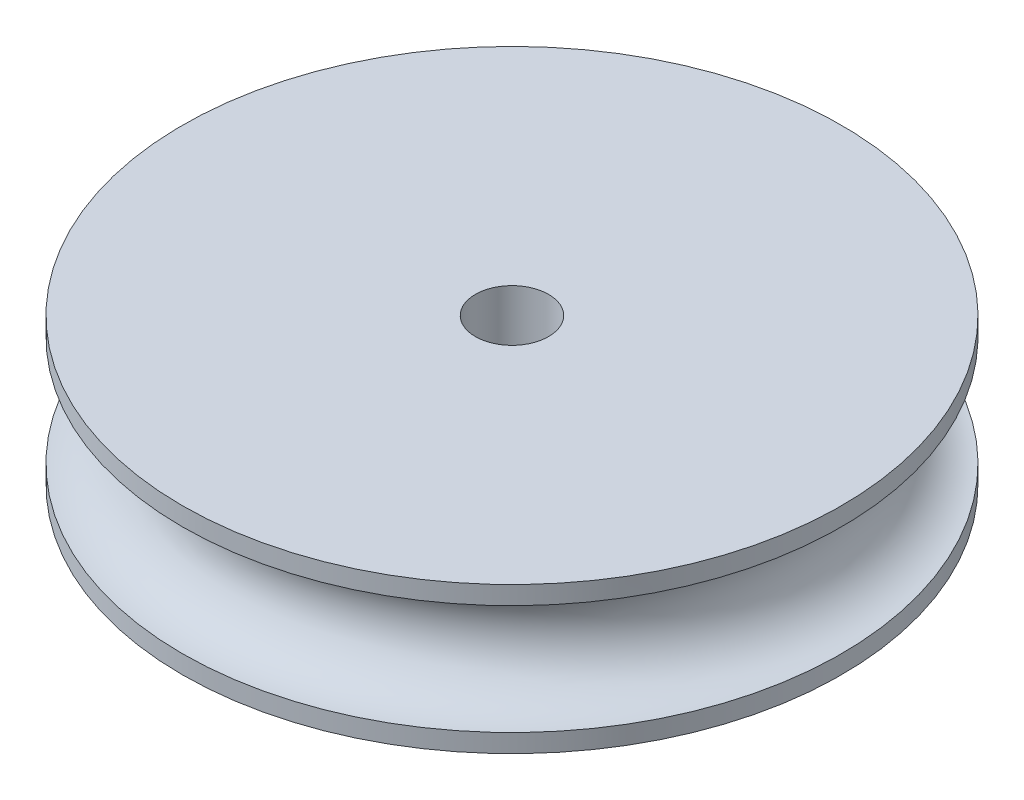
ISO-10303-21;
HEADER;
FILE_DESCRIPTION(('STEP AP214'),'2;1');
FILE_NAME('part.step','',(''),(''),'','','');
FILE_SCHEMA(('AUTOMOTIVE_DESIGN { 1 0 10303 214 1 1 1 1 }'));
ENDSEC;
DATA;
#1=APPLICATION_CONTEXT('core data for automotive mechanical design processes');
#2=APPLICATION_PROTOCOL_DEFINITION('international standard','automotive_design',2000,#1);
#3=PRODUCT_CONTEXT('',#1,'mechanical');
#4=PRODUCT('Part','Part','',(#3));
#5=PRODUCT_RELATED_PRODUCT_CATEGORY('part','',(#4));
#6=PRODUCT_DEFINITION_FORMATION('','',#4);
#7=PRODUCT_DEFINITION_CONTEXT('part definition',#1,'design');
#8=PRODUCT_DEFINITION('design','',#6,#7);
#9=PRODUCT_DEFINITION_SHAPE('','',#8);
#10=(LENGTH_UNIT() NAMED_UNIT(*) SI_UNIT(.MILLI.,.METRE.));
#11=(NAMED_UNIT(*) PLANE_ANGLE_UNIT() SI_UNIT($,.RADIAN.));
#12=(NAMED_UNIT(*) SI_UNIT($,.STERADIAN.) SOLID_ANGLE_UNIT());
#13=UNCERTAINTY_MEASURE_WITH_UNIT(LENGTH_MEASURE(1.E-05),#10,'distance_accuracy_value','');
#14=(GEOMETRIC_REPRESENTATION_CONTEXT(3) GLOBAL_UNCERTAINTY_ASSIGNED_CONTEXT((#13)) GLOBAL_UNIT_ASSIGNED_CONTEXT((#10,
#11,#12)) REPRESENTATION_CONTEXT('',''));
#15=CARTESIAN_POINT('',(0.,0.,0.));
#16=DIRECTION('',(0.,0.,1.));
#17=DIRECTION('',(1.,0.,0.));
#18=AXIS2_PLACEMENT_3D('',#15,#16,#17);
#19=CARTESIAN_POINT('',(-3.6732769603809E-13,46.5730343416542,53.));
#20=DIRECTION('',(0.,1.,0.));
#21=DIRECTION('',(0.,0.,1.));
#22=AXIS2_PLACEMENT_3D('',#19,#20,#21);
#23=CYLINDRICAL_SURFACE('',#22,9.);
#24=CARTESIAN_POINT('',(0.,47.0730343416542,53.));
#25=DIRECTION('',(0.,1.,0.));
#26=DIRECTION('',(0.,0.,1.));
#27=AXIS2_PLACEMENT_3D('',#24,#25,#26);
#28=CIRCLE('',#27,9.);
#29=CARTESIAN_POINT('',(0.,47.0730343416542,62.));
#30=VERTEX_POINT('',#29);
#31=EDGE_CURVE('E34',#30,#30,#28,.T.);
#32=ORIENTED_EDGE('',*,*,#31,.F.);
#33=EDGE_LOOP('',(#32));
#34=FACE_BOUND('',#33,.T.);
#35=CARTESIAN_POINT('',(-3.6732769603809E-13,46.5730343416542,53.));
#36=DIRECTION('',(0.,1.,0.));
#37=DIRECTION('',(0.,0.,1.));
#38=AXIS2_PLACEMENT_3D('',#35,#36,#37);
#39=CIRCLE('',#38,9.);
#40=CARTESIAN_POINT('',(-3.6732769603809E-13,46.5730343416542,62.));
#41=VERTEX_POINT('',#40);
#42=EDGE_CURVE('E10',#41,#41,#39,.T.);
#43=ORIENTED_EDGE('',*,*,#42,.T.);
#44=EDGE_LOOP('',(#43));
#45=FACE_BOUND('',#44,.T.);
#46=ADVANCED_FACE('F30',(#34,#45),#23,.T.);
#47=CARTESIAN_POINT('',(0.,50.0730343416542,53.));
#48=DIRECTION('',(0.,-1.,0.));
#49=DIRECTION('',(0.,0.,-1.));
#50=AXIS2_PLACEMENT_3D('',#47,#48,#49);
#51=CIRCLE('',#50,9.);
#52=CARTESIAN_POINT('',(0.,50.0730343416542,44.));
#53=VERTEX_POINT('',#52);
#54=EDGE_CURVE('E48',#53,#53,#51,.T.);
#55=ORIENTED_EDGE('',*,*,#54,.F.);
#56=EDGE_LOOP('',(#55));
#57=FACE_BOUND('',#56,.T.);
#58=CARTESIAN_POINT('',(-3.6732769603809E-13,50.5730343416542,53.));
#59=DIRECTION('',(0.,1.,0.));
#60=DIRECTION('',(0.,0.,1.));
#61=AXIS2_PLACEMENT_3D('',#58,#59,#60);
#62=CIRCLE('',#61,9.);
#63=CARTESIAN_POINT('',(-3.6732769603809E-13,50.5730343416542,62.));
#64=VERTEX_POINT('',#63);
#65=EDGE_CURVE('E38',#64,#64,#62,.T.);
#66=ORIENTED_EDGE('',*,*,#65,.F.);
#67=EDGE_LOOP('',(#66));
#68=FACE_BOUND('',#67,.T.);
#69=ADVANCED_FACE('F32',(#57,#68),#23,.T.);
#70=CARTESIAN_POINT('',(-3.6732769603809E-13,46.5730343416542,53.));
#71=DIRECTION('',(0.,1.,0.));
#72=DIRECTION('',(0.,0.,1.));
#73=AXIS2_PLACEMENT_3D('',#70,#71,#72);
#74=PLANE('',#73);
#75=CARTESIAN_POINT('',(-3.6732769603809E-13,46.5730343416542,53.));
#76=DIRECTION('',(0.,1.,0.));
#77=DIRECTION('',(0.,0.,1.));
#78=AXIS2_PLACEMENT_3D('',#75,#76,#77);
#79=CIRCLE('',#78,0.999999999999999);
#80=CARTESIAN_POINT('',(-3.6732769603809E-13,46.5730343416542,54.));
#81=VERTEX_POINT('',#80);
#82=EDGE_CURVE('E43',#81,#81,#79,.T.);
#83=ORIENTED_EDGE('',*,*,#82,.T.);
#84=EDGE_LOOP('',(#83));
#85=FACE_BOUND('',#84,.T.);
#86=ORIENTED_EDGE('',*,*,#42,.F.);
#87=EDGE_LOOP('',(#86));
#88=FACE_BOUND('',#87,.T.);
#89=ADVANCED_FACE('F61',(#85,#88),#74,.F.);
#90=CARTESIAN_POINT('',(-3.6732769603809E-13,50.5730343416542,53.));
#91=DIRECTION('',(0.,1.,0.));
#92=DIRECTION('',(0.,0.,1.));
#93=AXIS2_PLACEMENT_3D('',#90,#91,#92);
#94=PLANE('',#93);
#95=CARTESIAN_POINT('',(-3.6732769603809E-13,50.5730343416542,53.));
#96=DIRECTION('',(0.,1.,0.));
#97=DIRECTION('',(0.,0.,1.));
#98=AXIS2_PLACEMENT_3D('',#95,#96,#97);
#99=CIRCLE('',#98,0.999999999999999);
#100=CARTESIAN_POINT('',(-3.6732769603809E-13,50.5730343416542,54.));
#101=VERTEX_POINT('',#100);
#102=EDGE_CURVE('E46',#101,#101,#99,.T.);
#103=ORIENTED_EDGE('',*,*,#102,.F.);
#104=EDGE_LOOP('',(#103));
#105=FACE_BOUND('',#104,.T.);
#106=ORIENTED_EDGE('',*,*,#65,.T.);
#107=EDGE_LOOP('',(#106));
#108=FACE_BOUND('',#107,.T.);
#109=ADVANCED_FACE('F67',(#105,#108),#94,.T.);
#110=CARTESIAN_POINT('',(-3.6732769603809E-13,46.5730343416542,53.));
#111=DIRECTION('',(0.,1.,0.));
#112=DIRECTION('',(0.,0.,1.));
#113=AXIS2_PLACEMENT_3D('',#110,#111,#112);
#114=CYLINDRICAL_SURFACE('',#113,0.999999999999999);
#115=ORIENTED_EDGE('',*,*,#82,.F.);
#116=EDGE_LOOP('',(#115));
#117=FACE_BOUND('',#116,.T.);
#118=ORIENTED_EDGE('',*,*,#102,.T.);
#119=EDGE_LOOP('',(#118));
#120=FACE_BOUND('',#119,.T.);
#121=ADVANCED_FACE('F64',(#117,#120),#114,.F.);
#122=CARTESIAN_POINT('',(0.,48.5730343416542,53.));
#123=DIRECTION('',(0.,-1.,0.));
#124=DIRECTION('',(0.,0.,-1.));
#125=AXIS2_PLACEMENT_3D('',#122,#123,#124);
#126=TOROIDAL_SURFACE('',#125,9.,1.5);
#127=ORIENTED_EDGE('',*,*,#31,.T.);
#128=EDGE_LOOP('',(#127));
#129=FACE_BOUND('',#128,.T.);
#130=ORIENTED_EDGE('',*,*,#54,.T.);
#131=EDGE_LOOP('',(#130));
#132=FACE_BOUND('',#131,.T.);
#133=ADVANCED_FACE('F66',(#129,#132),#126,.F.);
#134=CLOSED_SHELL('',(#46,#69,#89,#109,#121,#133));
#135=MANIFOLD_SOLID_BREP('B2',#134);
#136=ADVANCED_BREP_SHAPE_REPRESENTATION('',(#18,#135),#14);
#137=SHAPE_DEFINITION_REPRESENTATION(#9,#136);
ENDSEC;
END-ISO-10303-21;
